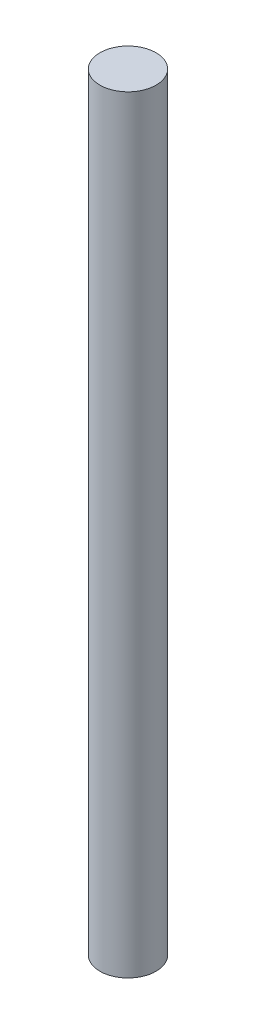
ISO-10303-21;
HEADER;
FILE_DESCRIPTION(('STEP AP214'),'2;1');
FILE_NAME('part.step','',(''),(''),'','','');
FILE_SCHEMA(('AUTOMOTIVE_DESIGN { 1 0 10303 214 1 1 1 1 }'));
ENDSEC;
DATA;
#1=APPLICATION_CONTEXT('core data for automotive mechanical design processes');
#2=APPLICATION_PROTOCOL_DEFINITION('international standard','automotive_design',2000,#1);
#3=PRODUCT_CONTEXT('',#1,'mechanical');
#4=PRODUCT('Part','Part','',(#3));
#5=PRODUCT_RELATED_PRODUCT_CATEGORY('part','',(#4));
#6=PRODUCT_DEFINITION_FORMATION('','',#4);
#7=PRODUCT_DEFINITION_CONTEXT('part definition',#1,'design');
#8=PRODUCT_DEFINITION('design','',#6,#7);
#9=PRODUCT_DEFINITION_SHAPE('','',#8);
#10=(LENGTH_UNIT() NAMED_UNIT(*) SI_UNIT(.MILLI.,.METRE.));
#11=(NAMED_UNIT(*) PLANE_ANGLE_UNIT() SI_UNIT($,.RADIAN.));
#12=(NAMED_UNIT(*) SI_UNIT($,.STERADIAN.) SOLID_ANGLE_UNIT());
#13=UNCERTAINTY_MEASURE_WITH_UNIT(LENGTH_MEASURE(1.E-05),#10,'distance_accuracy_value','');
#14=(GEOMETRIC_REPRESENTATION_CONTEXT(3) GLOBAL_UNCERTAINTY_ASSIGNED_CONTEXT((#13)) GLOBAL_UNIT_ASSIGNED_CONTEXT((#10,
#11,#12)) REPRESENTATION_CONTEXT('',''));
#15=CARTESIAN_POINT('',(0.,0.,0.));
#16=DIRECTION('',(0.,0.,1.));
#17=DIRECTION('',(1.,0.,0.));
#18=AXIS2_PLACEMENT_3D('',#15,#16,#17);
#19=CARTESIAN_POINT('',(0.,82.,0.));
#20=DIRECTION('',(0.,-1.,0.));
#21=DIRECTION('',(0.,0.,-1.));
#22=AXIS2_PLACEMENT_3D('',#19,#20,#21);
#23=CYLINDRICAL_SURFACE('',#22,3.);
#24=CARTESIAN_POINT('',(0.,82.,0.));
#25=DIRECTION('',(0.,1.,0.));
#26=DIRECTION('',(0.,0.,1.));
#27=AXIS2_PLACEMENT_3D('',#24,#25,#26);
#28=CIRCLE('',#27,3.);
#29=CARTESIAN_POINT('',(0.,82.,3.));
#30=VERTEX_POINT('',#29);
#31=EDGE_CURVE('E10',#30,#30,#28,.T.);
#32=ORIENTED_EDGE('',*,*,#31,.F.);
#33=EDGE_LOOP('',(#32));
#34=FACE_BOUND('',#33,.T.);
#35=CARTESIAN_POINT('',(0.,0.,0.));
#36=DIRECTION('',(0.,1.,0.));
#37=DIRECTION('',(0.,0.,1.));
#38=AXIS2_PLACEMENT_3D('',#35,#36,#37);
#39=CIRCLE('',#38,3.);
#40=CARTESIAN_POINT('',(0.,0.,3.));
#41=VERTEX_POINT('',#40);
#42=EDGE_CURVE('E44',#41,#41,#39,.T.);
#43=ORIENTED_EDGE('',*,*,#42,.T.);
#44=EDGE_LOOP('',(#43));
#45=FACE_BOUND('',#44,.T.);
#46=ADVANCED_FACE('F41',(#34,#45),#23,.T.);
#47=CARTESIAN_POINT('',(0.,82.,0.));
#48=DIRECTION('',(0.,1.,0.));
#49=DIRECTION('',(0.,0.,1.));
#50=AXIS2_PLACEMENT_3D('',#47,#48,#49);
#51=PLANE('',#50);
#52=ORIENTED_EDGE('',*,*,#31,.T.);
#53=EDGE_LOOP('',(#52));
#54=FACE_BOUND('',#53,.T.);
#55=ADVANCED_FACE('F58',(#54),#51,.T.);
#56=CARTESIAN_POINT('',(0.,0.,0.));
#57=DIRECTION('',(0.,1.,0.));
#58=DIRECTION('',(0.,0.,1.));
#59=AXIS2_PLACEMENT_3D('',#56,#57,#58);
#60=PLANE('',#59);
#61=ORIENTED_EDGE('',*,*,#42,.F.);
#62=EDGE_LOOP('',(#61));
#63=FACE_BOUND('',#62,.T.);
#64=ADVANCED_FACE('F56',(#63),#60,.F.);
#65=CLOSED_SHELL('',(#46,#55,#64));
#66=MANIFOLD_SOLID_BREP('B2',#65);
#67=ADVANCED_BREP_SHAPE_REPRESENTATION('',(#18,#66),#14);
#68=SHAPE_DEFINITION_REPRESENTATION(#9,#67);
ENDSEC;
END-ISO-10303-21;
